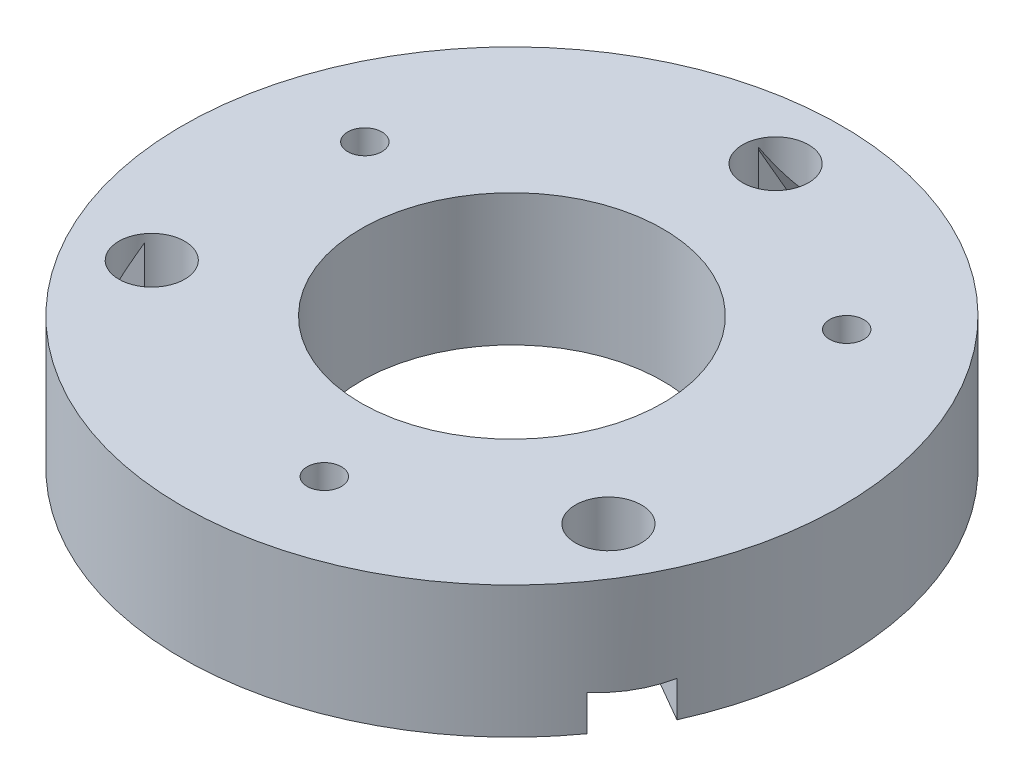
ISO-10303-21;
HEADER;
FILE_DESCRIPTION(('STEP AP214'),'2;1');
FILE_NAME('part.step','',(''),(''),'','','');
FILE_SCHEMA(('AUTOMOTIVE_DESIGN { 1 0 10303 214 1 1 1 1 }'));
ENDSEC;
DATA;
#1=APPLICATION_CONTEXT('core data for automotive mechanical design processes');
#2=APPLICATION_PROTOCOL_DEFINITION('international standard','automotive_design',2000,#1);
#3=PRODUCT_CONTEXT('',#1,'mechanical');
#4=PRODUCT('Part','Part','',(#3));
#5=PRODUCT_RELATED_PRODUCT_CATEGORY('part','',(#4));
#6=PRODUCT_DEFINITION_FORMATION('','',#4);
#7=PRODUCT_DEFINITION_CONTEXT('part definition',#1,'design');
#8=PRODUCT_DEFINITION('design','',#6,#7);
#9=PRODUCT_DEFINITION_SHAPE('','',#8);
#10=(LENGTH_UNIT() NAMED_UNIT(*) SI_UNIT(.MILLI.,.METRE.));
#11=(NAMED_UNIT(*) PLANE_ANGLE_UNIT() SI_UNIT($,.RADIAN.));
#12=(NAMED_UNIT(*) SI_UNIT($,.STERADIAN.) SOLID_ANGLE_UNIT());
#13=UNCERTAINTY_MEASURE_WITH_UNIT(LENGTH_MEASURE(1.E-05),#10,'distance_accuracy_value','');
#14=(GEOMETRIC_REPRESENTATION_CONTEXT(3) GLOBAL_UNCERTAINTY_ASSIGNED_CONTEXT((#13)) GLOBAL_UNIT_ASSIGNED_CONTEXT((#10,
#11,#12)) REPRESENTATION_CONTEXT('',''));
#15=CARTESIAN_POINT('',(0.,0.,0.));
#16=DIRECTION('',(0.,0.,1.));
#17=DIRECTION('',(1.,0.,0.));
#18=AXIS2_PLACEMENT_3D('',#15,#16,#17);
#19=CARTESIAN_POINT('',(0.,25.4,0.));
#20=DIRECTION('',(0.,-1.,0.));
#21=DIRECTION('',(0.,0.,-1.));
#22=AXIS2_PLACEMENT_3D('',#19,#20,#21);
#23=CYLINDRICAL_SURFACE('',#22,63.5);
#24=CARTESIAN_POINT('',(0.,25.4,0.));
#25=DIRECTION('',(0.,1.,0.));
#26=DIRECTION('',(0.,0.,1.));
#27=AXIS2_PLACEMENT_3D('',#24,#25,#26);
#28=CIRCLE('',#27,63.5);
#29=CARTESIAN_POINT('',(0.,25.4,63.5));
#30=VERTEX_POINT('',#29);
#31=EDGE_CURVE('E279',#30,#30,#28,.T.);
#32=ORIENTED_EDGE('',*,*,#31,.F.);
#33=EDGE_LOOP('',(#32));
#34=FACE_BOUND('',#33,.T.);
#35=DIRECTION('',(0.,-1.,0.));
#36=VECTOR('',#35,1.);
#37=CARTESIAN_POINT('',(57.891959208275,25.4,26.0915898141035));
#38=LINE('',#37,#36);
#39=CARTESIAN_POINT('',(57.891959208275,0.,26.0915898141035));
#40=VERTEX_POINT('',#39);
#41=CARTESIAN_POINT('',(57.891959208275,6.90130786407426,26.0915898141035));
#42=VERTEX_POINT('',#41);
#43=EDGE_CURVE('E164',#40,#42,#38,.F.);
#44=ORIENTED_EDGE('',*,*,#43,.F.);
#45=CARTESIAN_POINT('',(0.,0.,0.));
#46=DIRECTION('',(0.,1.,0.));
#47=DIRECTION('',(0.,0.,1.));
#48=AXIS2_PLACEMENT_3D('',#45,#46,#47);
#49=CIRCLE('',#48,63.5);
#50=CARTESIAN_POINT('',(6.35,0.,-63.1817022562704));
#51=VERTEX_POINT('',#50);
#52=EDGE_CURVE('E276',#40,#51,#49,.T.);
#53=ORIENTED_EDGE('',*,*,#52,.T.);
#54=DIRECTION('',(0.,-1.,0.));
#55=VECTOR('',#54,1.);
#56=CARTESIAN_POINT('',(6.35,25.4,-63.1817022562704));
#57=LINE('',#56,#55);
#58=CARTESIAN_POINT('',(6.35,6.90130786407426,-63.1817022562704));
#59=VERTEX_POINT('',#58);
#60=EDGE_CURVE('E293',#51,#59,#57,.F.);
#61=ORIENTED_EDGE('',*,*,#60,.T.);
#62=CARTESIAN_POINT('',(0.,116.335226280624,0.));
#63=DIRECTION('',(0.,0.5,-0.866025403784439));
#64=DIRECTION('',(0.,-0.866025403784439,-0.5));
#65=AXIS2_PLACEMENT_3D('',#62,#63,#64);
#66=ELLIPSE('',#65,127.,63.5);
#67=CARTESIAN_POINT('',(-6.35,6.90130786407426,-63.1817022562704));
#68=VERTEX_POINT('',#67);
#69=EDGE_CURVE('E248',#59,#68,#66,.T.);
#70=ORIENTED_EDGE('',*,*,#69,.T.);
#71=DIRECTION('',(0.,-1.,0.));
#72=VECTOR('',#71,1.);
#73=CARTESIAN_POINT('',(-6.35,25.4,-63.1817022562704));
#74=LINE('',#73,#72);
#75=CARTESIAN_POINT('',(-6.35,0.,-63.1817022562704));
#76=VERTEX_POINT('',#75);
#77=EDGE_CURVE('E296',#76,#68,#74,.F.);
#78=ORIENTED_EDGE('',*,*,#77,.F.);
#79=CARTESIAN_POINT('',(-57.8919592082746,0.,26.0915898141043));
#80=VERTEX_POINT('',#79);
#81=EDGE_CURVE('E283',#76,#80,#49,.T.);
#82=ORIENTED_EDGE('',*,*,#81,.T.);
#83=DIRECTION('',(0.,-1.,0.));
#84=VECTOR('',#83,1.);
#85=CARTESIAN_POINT('',(-57.8919592082746,25.4,26.0915898141043));
#86=LINE('',#85,#84);
#87=CARTESIAN_POINT('',(-57.8919592082746,6.90130786407427,26.0915898141043));
#88=VERTEX_POINT('',#87);
#89=EDGE_CURVE('E222',#80,#88,#86,.F.);
#90=ORIENTED_EDGE('',*,*,#89,.T.);
#91=CARTESIAN_POINT('',(0.,116.335226280624,0.));
#92=DIRECTION('',(-0.749999999999998,0.5,0.433012701892223));
#93=DIRECTION('',(-0.433012701892218,-0.866025403784439,0.250000000000002));
#94=AXIS2_PLACEMENT_3D('',#91,#92,#93);
#95=ELLIPSE('',#94,127.,63.5);
#96=CARTESIAN_POINT('',(-51.5419592082746,6.90130786407426,37.0901124421666));
#97=VERTEX_POINT('',#96);
#98=EDGE_CURVE('E216',#88,#97,#95,.T.);
#99=ORIENTED_EDGE('',*,*,#98,.T.);
#100=DIRECTION('',(0.,-1.,0.));
#101=VECTOR('',#100,1.);
#102=CARTESIAN_POINT('',(-51.5419592082746,25.4,37.0901124421666));
#103=LINE('',#102,#101);
#104=CARTESIAN_POINT('',(-51.5419592082745,0.,37.0901124421666));
#105=VERTEX_POINT('',#104);
#106=EDGE_CURVE('E225',#105,#97,#103,.F.);
#107=ORIENTED_EDGE('',*,*,#106,.F.);
#108=CARTESIAN_POINT('',(51.5419592082751,0.,37.0901124421659));
#109=VERTEX_POINT('',#108);
#110=EDGE_CURVE('E286',#105,#109,#49,.T.);
#111=ORIENTED_EDGE('',*,*,#110,.T.);
#112=DIRECTION('',(0.,-1.,0.));
#113=VECTOR('',#112,1.);
#114=CARTESIAN_POINT('',(51.5419592082751,25.4,37.0901124421659));
#115=LINE('',#114,#113);
#116=CARTESIAN_POINT('',(51.5419592082751,6.90130786407424,37.0901124421659));
#117=VERTEX_POINT('',#116);
#118=EDGE_CURVE('E194',#109,#117,#115,.F.);
#119=ORIENTED_EDGE('',*,*,#118,.T.);
#120=CARTESIAN_POINT('',(0.,116.335226280624,0.));
#121=DIRECTION('',(0.750000000000004,0.5,0.433012701892212));
#122=DIRECTION('',(0.433012701892222,-0.866025403784439,0.249999999999996));
#123=AXIS2_PLACEMENT_3D('',#120,#121,#122);
#124=ELLIPSE('',#123,127.,63.5);
#125=EDGE_CURVE('E191',#117,#42,#124,.T.);
#126=ORIENTED_EDGE('',*,*,#125,.T.);
#127=EDGE_LOOP('',(#44,#53,#61,#70,#78,#82,#90,#99,#107,#111,#119,#126));
#128=FACE_BOUND('',#127,.T.);
#129=ADVANCED_FACE('F33',(#34,#128),#23,.T.);
#130=CARTESIAN_POINT('',(0.,25.4,0.));
#131=DIRECTION('',(0.,1.,0.));
#132=DIRECTION('',(0.,0.,1.));
#133=AXIS2_PLACEMENT_3D('',#130,#131,#132);
#134=PLANE('',#133);
#135=CARTESIAN_POINT('',(8.72378726861535,25.4,44.8799948272273));
#136=DIRECTION('',(0.,1.,0.));
#137=DIRECTION('',(0.866025403784443,0.,-0.499999999999992));
#138=AXIS2_PLACEMENT_3D('',#135,#136,#137);
#139=CIRCLE('',#138,3.30200000000001);
#140=CARTESIAN_POINT('',(11.5834031519116,25.4,43.2289948272273));
#141=VERTEX_POINT('',#140);
#142=EDGE_CURVE('E329',#141,#141,#139,.T.);
#143=ORIENTED_EDGE('',*,*,#142,.F.);
#144=EDGE_LOOP('',(#143));
#145=FACE_BOUND('',#144,.T.);
#146=CARTESIAN_POINT('',(34.5053220077852,25.4,-29.9950188054459));
#147=DIRECTION('',(0.,1.,0.));
#148=DIRECTION('',(-0.866025403784436,0.,-0.500000000000004));
#149=AXIS2_PLACEMENT_3D('',#146,#147,#148);
#150=CIRCLE('',#149,3.30200000000001);
#151=CARTESIAN_POINT('',(31.645706124489,25.4,-31.646018805446));
#152=VERTEX_POINT('',#151);
#153=EDGE_CURVE('E323',#152,#152,#150,.T.);
#154=ORIENTED_EDGE('',*,*,#153,.F.);
#155=EDGE_LOOP('',(#154));
#156=FACE_BOUND('',#155,.T.);
#157=CARTESIAN_POINT('',(-43.2291092764008,25.4,-14.8849760217811));
#158=DIRECTION('',(0.,1.,0.));
#159=DIRECTION('',(0.,0.,1.));
#160=AXIS2_PLACEMENT_3D('',#157,#158,#159);
#161=CIRCLE('',#160,3.30200000000001);
#162=CARTESIAN_POINT('',(-43.2291092764008,25.4,-11.5829760217811));
#163=VERTEX_POINT('',#162);
#164=EDGE_CURVE('E317',#163,#163,#161,.T.);
#165=ORIENTED_EDGE('',*,*,#164,.F.);
#166=EDGE_LOOP('',(#165));
#167=FACE_BOUND('',#166,.T.);
#168=CARTESIAN_POINT('',(43.9940905122527,25.4,25.3999999999981));
#169=DIRECTION('',(0.,1.,0.));
#170=DIRECTION('',(0.,0.,1.));
#171=AXIS2_PLACEMENT_3D('',#168,#169,#170);
#172=CIRCLE('',#171,6.35000000000278);
#173=CARTESIAN_POINT('',(43.9940905122527,25.4,31.7500000000009));
#174=VERTEX_POINT('',#173);
#175=EDGE_CURVE('E261',#174,#174,#172,.T.);
#176=ORIENTED_EDGE('',*,*,#175,.F.);
#177=EDGE_LOOP('',(#176));
#178=FACE_BOUND('',#177,.T.);
#179=CARTESIAN_POINT('',(0.,25.4,0.));
#180=DIRECTION('',(0.,1.,0.));
#181=DIRECTION('',(0.,0.,1.));
#182=AXIS2_PLACEMENT_3D('',#179,#180,#181);
#183=CIRCLE('',#182,29.083);
#184=CARTESIAN_POINT('',(0.,25.4,29.083));
#185=VERTEX_POINT('',#184);
#186=EDGE_CURVE('E273',#185,#185,#183,.T.);
#187=ORIENTED_EDGE('',*,*,#186,.F.);
#188=EDGE_LOOP('',(#187));
#189=FACE_BOUND('',#188,.T.);
#190=ORIENTED_EDGE('',*,*,#31,.T.);
#191=EDGE_LOOP('',(#190));
#192=FACE_BOUND('',#191,.T.);
#193=CARTESIAN_POINT('',(0.,25.4,-50.8));
#194=DIRECTION('',(0.,1.,0.));
#195=DIRECTION('',(0.,0.,1.));
#196=AXIS2_PLACEMENT_3D('',#193,#194,#195);
#197=CIRCLE('',#196,6.35);
#198=CARTESIAN_POINT('',(0.,25.4,-44.45));
#199=VERTEX_POINT('',#198);
#200=EDGE_CURVE('E267',#199,#199,#197,.T.);
#201=ORIENTED_EDGE('',*,*,#200,.F.);
#202=EDGE_LOOP('',(#201));
#203=FACE_BOUND('',#202,.T.);
#204=CARTESIAN_POINT('',(-43.9940905122462,25.4,25.4000000000019));
#205=DIRECTION('',(0.,1.,0.));
#206=DIRECTION('',(0.,0.,1.));
#207=AXIS2_PLACEMENT_3D('',#204,#205,#206);
#208=CIRCLE('',#207,6.35000000000412);
#209=CARTESIAN_POINT('',(-43.9940905122462,25.4,31.750000000006));
#210=VERTEX_POINT('',#209);
#211=EDGE_CURVE('E255',#210,#210,#208,.T.);
#212=ORIENTED_EDGE('',*,*,#211,.F.);
#213=EDGE_LOOP('',(#212));
#214=FACE_BOUND('',#213,.T.);
#215=ADVANCED_FACE('F344',(#145,#156,#167,#178,#189,#192,#203,#214),#134,.T.);
#216=CARTESIAN_POINT('',(0.,0.,0.));
#217=DIRECTION('',(0.,1.,0.));
#218=DIRECTION('',(0.,0.,1.));
#219=AXIS2_PLACEMENT_3D('',#216,#217,#218);
#220=PLANE('',#219);
#221=CARTESIAN_POINT('',(8.72378726861535,0.,44.8799948272273));
#222=DIRECTION('',(0.,1.,0.));
#223=DIRECTION('',(0.866025403784443,0.,-0.499999999999992));
#224=AXIS2_PLACEMENT_3D('',#221,#222,#223);
#225=CIRCLE('',#224,3.30200000000001);
#226=CARTESIAN_POINT('',(11.5834031519116,0.,43.2289948272273));
#227=VERTEX_POINT('',#226);
#228=EDGE_CURVE('E326',#227,#227,#225,.T.);
#229=ORIENTED_EDGE('',*,*,#228,.T.);
#230=EDGE_LOOP('',(#229));
#231=FACE_BOUND('',#230,.T.);
#232=CARTESIAN_POINT('',(34.5053220077852,0.,-29.9950188054459));
#233=DIRECTION('',(0.,1.,0.));
#234=DIRECTION('',(-0.866025403784436,0.,-0.500000000000004));
#235=AXIS2_PLACEMENT_3D('',#232,#233,#234);
#236=CIRCLE('',#235,3.30200000000001);
#237=CARTESIAN_POINT('',(31.645706124489,0.,-31.646018805446));
#238=VERTEX_POINT('',#237);
#239=EDGE_CURVE('E320',#238,#238,#236,.T.);
#240=ORIENTED_EDGE('',*,*,#239,.T.);
#241=EDGE_LOOP('',(#240));
#242=FACE_BOUND('',#241,.T.);
#243=CARTESIAN_POINT('',(-43.2291092764008,0.,-14.8849760217811));
#244=DIRECTION('',(0.,1.,0.));
#245=DIRECTION('',(0.,0.,1.));
#246=AXIS2_PLACEMENT_3D('',#243,#244,#245);
#247=CIRCLE('',#246,3.30200000000001);
#248=CARTESIAN_POINT('',(-43.2291092764008,0.,-11.5829760217811));
#249=VERTEX_POINT('',#248);
#250=EDGE_CURVE('E186',#249,#249,#247,.T.);
#251=ORIENTED_EDGE('',*,*,#250,.T.);
#252=EDGE_LOOP('',(#251));
#253=FACE_BOUND('',#252,.T.);
#254=CARTESIAN_POINT('',(0.,0.,0.));
#255=DIRECTION('',(0.,1.,0.));
#256=DIRECTION('',(0.,0.,1.));
#257=AXIS2_PLACEMENT_3D('',#254,#255,#256);
#258=CIRCLE('',#257,29.083);
#259=CARTESIAN_POINT('',(0.,0.,29.083));
#260=VERTEX_POINT('',#259);
#261=EDGE_CURVE('E270',#260,#260,#258,.T.);
#262=ORIENTED_EDGE('',*,*,#261,.T.);
#263=EDGE_LOOP('',(#262));
#264=FACE_BOUND('',#263,.T.);
#265=DIRECTION('',(0.866025403784443,0.,0.499999999999992));
#266=VECTOR('',#265,1.);
#267=CARTESIAN_POINT('',(49.3863924359884,0.,21.1808985485136));
#268=LINE('',#267,#266);
#269=CARTESIAN_POINT('',(49.3863924359884,0.,21.1808985485136));
#270=VERTEX_POINT('',#269);
#271=EDGE_CURVE('E165',#270,#40,#268,.T.);
#272=ORIENTED_EDGE('',*,*,#271,.F.);
#273=DIRECTION('',(-0.499999999999992,0.,0.866025403784443));
#274=VECTOR('',#273,1.);
#275=CARTESIAN_POINT('',(49.3863924359884,0.,21.1808985485136));
#276=LINE('',#275,#274);
#277=CARTESIAN_POINT('',(49.1168727278416,0.,21.6477203766649));
#278=VERTEX_POINT('',#277);
#279=EDGE_CURVE('E178',#270,#278,#276,.T.);
#280=ORIENTED_EDGE('',*,*,#279,.T.);
#281=CARTESIAN_POINT('',(43.9940905122527,0.,25.3999999999981));
#282=DIRECTION('',(0.,1.,0.));
#283=DIRECTION('',(0.,0.,1.));
#284=AXIS2_PLACEMENT_3D('',#281,#282,#283);
#285=CIRCLE('',#284,6.35000000000278);
#286=CARTESIAN_POINT('',(43.305912144138,0.,31.7125993484198));
#287=VERTEX_POINT('',#286);
#288=EDGE_CURVE('E258',#278,#287,#285,.T.);
#289=ORIENTED_EDGE('',*,*,#288,.T.);
#290=CARTESIAN_POINT('',(43.0363924359885,0.,32.179421176576));
#291=VERTEX_POINT('',#290);
#292=EDGE_CURVE('E174',#287,#291,#276,.T.);
#293=ORIENTED_EDGE('',*,*,#292,.T.);
#294=DIRECTION('',(0.866025403784443,0.,0.499999999999992));
#295=VECTOR('',#294,1.);
#296=CARTESIAN_POINT('',(43.0363924359885,0.,32.179421176576));
#297=LINE('',#296,#295);
#298=EDGE_CURVE('E182',#291,#109,#297,.T.);
#299=ORIENTED_EDGE('',*,*,#298,.T.);
#300=ORIENTED_EDGE('',*,*,#110,.F.);
#301=DIRECTION('',(-0.866025403784436,0.,0.500000000000004));
#302=VECTOR('',#301,1.);
#303=CARTESIAN_POINT('',(-43.036392435988,0.,32.1794211765766));
#304=LINE('',#303,#302);
#305=CARTESIAN_POINT('',(-43.036392435988,0.,32.1794211765766));
#306=VERTEX_POINT('',#305);
#307=EDGE_CURVE('E199',#306,#105,#304,.T.);
#308=ORIENTED_EDGE('',*,*,#307,.F.);
#309=DIRECTION('',(-0.500000000000004,0.,-0.866025403784436));
#310=VECTOR('',#309,1.);
#311=CARTESIAN_POINT('',(-43.036392435988,0.,32.1794211765766));
#312=LINE('',#311,#310);
#313=CARTESIAN_POINT('',(-43.3059121441348,0.,31.7125993484253));
#314=VERTEX_POINT('',#313);
#315=EDGE_CURVE('E213',#306,#314,#312,.T.);
#316=ORIENTED_EDGE('',*,*,#315,.T.);
#317=CARTESIAN_POINT('',(-43.9940905122462,0.,25.4000000000019));
#318=DIRECTION('',(0.,1.,0.));
#319=DIRECTION('',(0.,0.,1.));
#320=AXIS2_PLACEMENT_3D('',#317,#318,#319);
#321=CIRCLE('',#320,6.35000000000412);
#322=CARTESIAN_POINT('',(-49.1168727278383,0.,21.6477203766708));
#323=VERTEX_POINT('',#322);
#324=EDGE_CURVE('E254',#314,#323,#321,.T.);
#325=ORIENTED_EDGE('',*,*,#324,.T.);
#326=CARTESIAN_POINT('',(-49.3863924359881,0.,21.1808985485143));
#327=VERTEX_POINT('',#326);
#328=EDGE_CURVE('E217',#323,#327,#312,.T.);
#329=ORIENTED_EDGE('',*,*,#328,.T.);
#330=DIRECTION('',(-0.866025403784436,0.,0.500000000000004));
#331=VECTOR('',#330,1.);
#332=CARTESIAN_POINT('',(-49.3863924359881,0.,21.1808985485143));
#333=LINE('',#332,#331);
#334=EDGE_CURVE('E198',#327,#80,#333,.T.);
#335=ORIENTED_EDGE('',*,*,#334,.T.);
#336=ORIENTED_EDGE('',*,*,#81,.F.);
#337=DIRECTION('',(0.,0.,-1.));
#338=VECTOR('',#337,1.);
#339=CARTESIAN_POINT('',(-6.35,0.,-53.3603197250904));
#340=LINE('',#339,#338);
#341=CARTESIAN_POINT('',(-6.35,0.,-53.3603197250904));
#342=VERTEX_POINT('',#341);
#343=EDGE_CURVE('E229',#342,#76,#340,.T.);
#344=ORIENTED_EDGE('',*,*,#343,.F.);
#345=DIRECTION('',(1.,0.,0.));
#346=VECTOR('',#345,1.);
#347=CARTESIAN_POINT('',(-6.35,0.,-53.3603197250904));
#348=LINE('',#347,#346);
#349=CARTESIAN_POINT('',(-5.81096058369982,0.,-53.3603197250904));
#350=VERTEX_POINT('',#349);
#351=EDGE_CURVE('E245',#342,#350,#348,.T.);
#352=ORIENTED_EDGE('',*,*,#351,.T.);
#353=CARTESIAN_POINT('',(0.,0.,-50.8));
#354=DIRECTION('',(0.,1.,0.));
#355=DIRECTION('',(0.,0.,1.));
#356=AXIS2_PLACEMENT_3D('',#353,#354,#355);
#357=CIRCLE('',#356,6.35);
#358=CARTESIAN_POINT('',(5.81096058369982,0.,-53.3603197250904));
#359=VERTEX_POINT('',#358);
#360=EDGE_CURVE('E264',#350,#359,#357,.T.);
#361=ORIENTED_EDGE('',*,*,#360,.T.);
#362=CARTESIAN_POINT('',(6.35,0.,-53.3603197250904));
#363=VERTEX_POINT('',#362);
#364=EDGE_CURVE('E249',#359,#363,#348,.T.);
#365=ORIENTED_EDGE('',*,*,#364,.T.);
#366=DIRECTION('',(0.,0.,-1.));
#367=VECTOR('',#366,1.);
#368=CARTESIAN_POINT('',(6.35,0.,-53.3603197250904));
#369=LINE('',#368,#367);
#370=EDGE_CURVE('E228',#363,#51,#369,.T.);
#371=ORIENTED_EDGE('',*,*,#370,.T.);
#372=ORIENTED_EDGE('',*,*,#52,.F.);
#373=EDGE_LOOP('',(#272,#280,#289,#293,#299,#300,#308,#316,#325,#329,#335,#336,#344,#352,#361,
#365,#371,#372));
#374=FACE_BOUND('',#373,.T.);
#375=ADVANCED_FACE('F314',(#231,#242,#253,#264,#374),#220,.F.);
#376=CARTESIAN_POINT('',(0.,25.4,0.));
#377=DIRECTION('',(0.,-1.,0.));
#378=DIRECTION('',(0.,0.,-1.));
#379=AXIS2_PLACEMENT_3D('',#376,#377,#378);
#380=CYLINDRICAL_SURFACE('',#379,29.083);
#381=ORIENTED_EDGE('',*,*,#186,.T.);
#382=EDGE_LOOP('',(#381));
#383=FACE_BOUND('',#382,.T.);
#384=ORIENTED_EDGE('',*,*,#261,.F.);
#385=EDGE_LOOP('',(#384));
#386=FACE_BOUND('',#385,.T.);
#387=ADVANCED_FACE('F591',(#383,#386),#380,.F.);
#388=CARTESIAN_POINT('',(0.,25.4,-50.8));
#389=DIRECTION('',(0.,-1.,0.));
#390=DIRECTION('',(0.,0.,-1.));
#391=AXIS2_PLACEMENT_3D('',#388,#389,#390);
#392=CYLINDRICAL_SURFACE('',#391,6.35);
#393=DIRECTION('',(0.,-1.,0.));
#394=VECTOR('',#393,1.);
#395=CARTESIAN_POINT('',(-5.81096058369982,25.4,-53.3603197250904));
#396=LINE('',#395,#394);
#397=CARTESIAN_POINT('',(-5.81096058369982,23.9124414086474,-53.3603197250904));
#398=VERTEX_POINT('',#397);
#399=EDGE_CURVE('E291',#398,#350,#396,.T.);
#400=ORIENTED_EDGE('',*,*,#399,.F.);
#401=CARTESIAN_POINT('',(0.,28.3470452561248,-50.8));
#402=DIRECTION('',(0.,0.5,-0.866025403784439));
#403=DIRECTION('',(0.,-0.866025403784439,-0.5));
#404=AXIS2_PLACEMENT_3D('',#401,#402,#403);
#405=ELLIPSE('',#404,12.7,6.35);
#406=CARTESIAN_POINT('',(5.81096058369982,23.9124414086474,-53.3603197250904));
#407=VERTEX_POINT('',#406);
#408=EDGE_CURVE('E282',#407,#398,#405,.T.);
#409=ORIENTED_EDGE('',*,*,#408,.F.);
#410=DIRECTION('',(0.,-1.,0.));
#411=VECTOR('',#410,1.);
#412=CARTESIAN_POINT('',(5.81096058369982,25.4,-53.3603197250904));
#413=LINE('',#412,#411);
#414=EDGE_CURVE('E288',#359,#407,#413,.F.);
#415=ORIENTED_EDGE('',*,*,#414,.F.);
#416=ORIENTED_EDGE('',*,*,#360,.F.);
#417=EDGE_LOOP('',(#400,#409,#415,#416));
#418=FACE_BOUND('',#417,.T.);
#419=ORIENTED_EDGE('',*,*,#200,.T.);
#420=EDGE_LOOP('',(#419));
#421=FACE_BOUND('',#420,.T.);
#422=ADVANCED_FACE('F374',(#418,#421),#392,.F.);
#423=CARTESIAN_POINT('',(43.9940905122527,25.4,25.3999999999981));
#424=DIRECTION('',(0.,-1.,0.));
#425=DIRECTION('',(0.,0.,-1.));
#426=AXIS2_PLACEMENT_3D('',#423,#424,#425);
#427=CYLINDRICAL_SURFACE('',#426,6.35000000000278);
#428=DIRECTION('',(0.,-1.,0.));
#429=VECTOR('',#428,1.);
#430=CARTESIAN_POINT('',(49.1168727278416,25.4,21.6477203766649));
#431=LINE('',#430,#429);
#432=CARTESIAN_POINT('',(49.1168727278416,23.9124414086474,21.6477203766649));
#433=VERTEX_POINT('',#432);
#434=EDGE_CURVE('E11',#433,#278,#431,.T.);
#435=ORIENTED_EDGE('',*,*,#434,.F.);
#436=CARTESIAN_POINT('',(43.9940905122527,28.3470452561215,25.3999999999981));
#437=DIRECTION('',(0.750000000000004,0.5,0.433012701892212));
#438=DIRECTION('',(0.433012701892222,-0.866025403784439,0.249999999999996));
#439=AXIS2_PLACEMENT_3D('',#436,#437,#438);
#440=ELLIPSE('',#439,12.7000000000056,6.35000000000278);
#441=CARTESIAN_POINT('',(43.305912144138,23.9124414086474,31.7125993484198));
#442=VERTEX_POINT('',#441);
#443=EDGE_CURVE('E171',#442,#433,#440,.T.);
#444=ORIENTED_EDGE('',*,*,#443,.F.);
#445=DIRECTION('',(0.,-1.,0.));
#446=VECTOR('',#445,1.);
#447=CARTESIAN_POINT('',(43.305912144138,25.4,31.7125993484198));
#448=LINE('',#447,#446);
#449=EDGE_CURVE('E40',#287,#442,#448,.F.);
#450=ORIENTED_EDGE('',*,*,#449,.F.);
#451=ORIENTED_EDGE('',*,*,#288,.F.);
#452=EDGE_LOOP('',(#435,#444,#450,#451));
#453=FACE_BOUND('',#452,.T.);
#454=ORIENTED_EDGE('',*,*,#175,.T.);
#455=EDGE_LOOP('',(#454));
#456=FACE_BOUND('',#455,.T.);
#457=ADVANCED_FACE('F311',(#453,#456),#427,.F.);
#458=CARTESIAN_POINT('',(-43.9940905122462,25.4,25.4000000000019));
#459=DIRECTION('',(0.,-1.,0.));
#460=DIRECTION('',(0.,0.,-1.));
#461=AXIS2_PLACEMENT_3D('',#458,#459,#460);
#462=CYLINDRICAL_SURFACE('',#461,6.35000000000412);
#463=DIRECTION('',(0.,-1.,0.));
#464=VECTOR('',#463,1.);
#465=CARTESIAN_POINT('',(-43.3059121441348,25.4,31.7125993484253));
#466=LINE('',#465,#464);
#467=CARTESIAN_POINT('',(-43.3059121441348,23.9124414086474,31.7125993484253));
#468=VERTEX_POINT('',#467);
#469=EDGE_CURVE('E303',#468,#314,#466,.T.);
#470=ORIENTED_EDGE('',*,*,#469,.F.);
#471=CARTESIAN_POINT('',(-43.9940905122462,28.347045256128,25.4000000000019));
#472=DIRECTION('',(-0.749999999999998,0.5,0.433012701892223));
#473=DIRECTION('',(-0.433012701892218,-0.866025403784439,0.250000000000002));
#474=AXIS2_PLACEMENT_3D('',#471,#472,#473);
#475=ELLIPSE('',#474,12.7000000000082,6.35000000000412);
#476=CARTESIAN_POINT('',(-49.1168727278383,23.9124414086474,21.6477203766708));
#477=VERTEX_POINT('',#476);
#478=EDGE_CURVE('E299',#477,#468,#475,.T.);
#479=ORIENTED_EDGE('',*,*,#478,.F.);
#480=DIRECTION('',(0.,-1.,0.));
#481=VECTOR('',#480,1.);
#482=CARTESIAN_POINT('',(-49.1168727278383,25.4,21.6477203766708));
#483=LINE('',#482,#481);
#484=EDGE_CURVE('E301',#323,#477,#483,.F.);
#485=ORIENTED_EDGE('',*,*,#484,.F.);
#486=ORIENTED_EDGE('',*,*,#324,.F.);
#487=EDGE_LOOP('',(#470,#479,#485,#486));
#488=FACE_BOUND('',#487,.T.);
#489=ORIENTED_EDGE('',*,*,#211,.T.);
#490=EDGE_LOOP('',(#489));
#491=FACE_BOUND('',#490,.T.);
#492=ADVANCED_FACE('F362',(#488,#491),#462,.F.);
#493=CARTESIAN_POINT('',(-6.35,0.,0.));
#494=DIRECTION('',(1.,0.,0.));
#495=DIRECTION('',(0.,0.,-1.));
#496=AXIS2_PLACEMENT_3D('',#493,#494,#495);
#497=PLANE('',#496);
#498=ORIENTED_EDGE('',*,*,#77,.T.);
#499=DIRECTION('',(0.,0.866025403784439,0.5));
#500=VECTOR('',#499,1.);
#501=CARTESIAN_POINT('',(-6.35,6.35,-63.5));
#502=LINE('',#501,#500);
#503=CARTESIAN_POINT('',(-6.35,23.9124414086474,-53.3603197250904));
#504=VERTEX_POINT('',#503);
#505=EDGE_CURVE('E231',#68,#504,#502,.T.);
#506=ORIENTED_EDGE('',*,*,#505,.T.);
#507=DIRECTION('',(0.,-1.,0.));
#508=VECTOR('',#507,1.);
#509=CARTESIAN_POINT('',(-6.35,23.9124414086474,-53.3603197250904));
#510=LINE('',#509,#508);
#511=EDGE_CURVE('E234',#504,#342,#510,.T.);
#512=ORIENTED_EDGE('',*,*,#511,.T.);
#513=ORIENTED_EDGE('',*,*,#343,.T.);
#514=EDGE_LOOP('',(#498,#506,#512,#513));
#515=FACE_BOUND('',#514,.T.);
#516=ADVANCED_FACE('F364',(#515),#497,.T.);
#517=CARTESIAN_POINT('',(6.35,0.,0.));
#518=DIRECTION('',(1.,0.,0.));
#519=DIRECTION('',(0.,0.,-1.));
#520=AXIS2_PLACEMENT_3D('',#517,#518,#519);
#521=PLANE('',#520);
#522=ORIENTED_EDGE('',*,*,#370,.F.);
#523=DIRECTION('',(0.,-1.,0.));
#524=VECTOR('',#523,1.);
#525=CARTESIAN_POINT('',(6.35,23.9124414086474,-53.3603197250904));
#526=LINE('',#525,#524);
#527=CARTESIAN_POINT('',(6.35,23.9124414086474,-53.3603197250904));
#528=VERTEX_POINT('',#527);
#529=EDGE_CURVE('E232',#528,#363,#526,.T.);
#530=ORIENTED_EDGE('',*,*,#529,.F.);
#531=DIRECTION('',(0.,0.866025403784439,0.5));
#532=VECTOR('',#531,1.);
#533=CARTESIAN_POINT('',(6.35,6.35,-63.5));
#534=LINE('',#533,#532);
#535=EDGE_CURVE('E240',#59,#528,#534,.T.);
#536=ORIENTED_EDGE('',*,*,#535,.F.);
#537=ORIENTED_EDGE('',*,*,#60,.F.);
#538=EDGE_LOOP('',(#522,#530,#536,#537));
#539=FACE_BOUND('',#538,.T.);
#540=ADVANCED_FACE('F371',(#539),#521,.F.);
#541=CARTESIAN_POINT('',(-6.35,23.9124414086474,-53.3603197250904));
#542=DIRECTION('',(0.,0.,1.));
#543=DIRECTION('',(0.,-1.,0.));
#544=AXIS2_PLACEMENT_3D('',#541,#542,#543);
#545=PLANE('',#544);
#546=ORIENTED_EDGE('',*,*,#399,.T.);
#547=ORIENTED_EDGE('',*,*,#351,.F.);
#548=ORIENTED_EDGE('',*,*,#511,.F.);
#549=DIRECTION('',(1.,0.,0.));
#550=VECTOR('',#549,1.);
#551=CARTESIAN_POINT('',(-6.35,23.9124414086474,-53.3603197250904));
#552=LINE('',#551,#550);
#553=EDGE_CURVE('E250',#504,#398,#552,.T.);
#554=ORIENTED_EDGE('',*,*,#553,.T.);
#555=EDGE_LOOP('',(#546,#547,#548,#554));
#556=FACE_BOUND('',#555,.T.);
#557=ADVANCED_FACE('F421',(#556),#545,.F.);
#558=CARTESIAN_POINT('',(-6.35,6.35,-63.5));
#559=DIRECTION('',(0.,0.5,-0.866025403784439));
#560=DIRECTION('',(0.,0.866025403784439,0.5));
#561=AXIS2_PLACEMENT_3D('',#558,#559,#560);
#562=PLANE('',#561);
#563=ORIENTED_EDGE('',*,*,#69,.F.);
#564=ORIENTED_EDGE('',*,*,#535,.T.);
#565=EDGE_CURVE('E237',#407,#528,#552,.T.);
#566=ORIENTED_EDGE('',*,*,#565,.F.);
#567=ORIENTED_EDGE('',*,*,#408,.T.);
#568=ORIENTED_EDGE('',*,*,#553,.F.);
#569=ORIENTED_EDGE('',*,*,#505,.F.);
#570=EDGE_LOOP('',(#563,#564,#566,#567,#568,#569));
#571=FACE_BOUND('',#570,.T.);
#572=ADVANCED_FACE('F415',(#571),#562,.F.);
#573=ORIENTED_EDGE('',*,*,#414,.T.);
#574=ORIENTED_EDGE('',*,*,#565,.T.);
#575=ORIENTED_EDGE('',*,*,#529,.T.);
#576=ORIENTED_EDGE('',*,*,#364,.F.);
#577=EDGE_LOOP('',(#573,#574,#575,#576));
#578=FACE_BOUND('',#577,.T.);
#579=ADVANCED_FACE('F428',(#578),#545,.F.);
#580=CARTESIAN_POINT('',(3.17500000000003,0.,5.49926131403117));
#581=DIRECTION('',(-0.500000000000004,0.,-0.866025403784436));
#582=DIRECTION('',(-0.866025403784436,0.,0.500000000000004));
#583=AXIS2_PLACEMENT_3D('',#580,#581,#582);
#584=PLANE('',#583);
#585=ORIENTED_EDGE('',*,*,#106,.T.);
#586=DIRECTION('',(0.433012701892218,0.866025403784439,-0.250000000000002));
#587=VECTOR('',#586,1.);
#588=CARTESIAN_POINT('',(-51.8176131403117,6.35,37.2492613140314));
#589=LINE('',#588,#587);
#590=CARTESIAN_POINT('',(-43.036392435988,23.9124414086474,32.1794211765766));
#591=VERTEX_POINT('',#590);
#592=EDGE_CURVE('E201',#97,#591,#589,.T.);
#593=ORIENTED_EDGE('',*,*,#592,.T.);
#594=DIRECTION('',(0.,-1.,0.));
#595=VECTOR('',#594,1.);
#596=CARTESIAN_POINT('',(-43.036392435988,23.9124414086474,32.1794211765766));
#597=LINE('',#596,#595);
#598=EDGE_CURVE('E204',#591,#306,#597,.T.);
#599=ORIENTED_EDGE('',*,*,#598,.T.);
#600=ORIENTED_EDGE('',*,*,#307,.T.);
#601=EDGE_LOOP('',(#585,#593,#599,#600));
#602=FACE_BOUND('',#601,.T.);
#603=ADVANCED_FACE('F394',(#602),#584,.T.);
#604=CARTESIAN_POINT('',(-3.17500000000003,0.,-5.49926131403117));
#605=DIRECTION('',(-0.500000000000004,0.,-0.866025403784436));
#606=DIRECTION('',(-0.866025403784436,0.,0.500000000000004));
#607=AXIS2_PLACEMENT_3D('',#604,#605,#606);
#608=PLANE('',#607);
#609=ORIENTED_EDGE('',*,*,#334,.F.);
#610=DIRECTION('',(0.,-1.,0.));
#611=VECTOR('',#610,1.);
#612=CARTESIAN_POINT('',(-49.3863924359881,23.9124414086474,21.1808985485142));
#613=LINE('',#612,#611);
#614=CARTESIAN_POINT('',(-49.3863924359881,23.9124414086474,21.1808985485142));
#615=VERTEX_POINT('',#614);
#616=EDGE_CURVE('E202',#615,#327,#613,.T.);
#617=ORIENTED_EDGE('',*,*,#616,.F.);
#618=DIRECTION('',(0.433012701892218,0.866025403784439,-0.250000000000002));
#619=VECTOR('',#618,1.);
#620=CARTESIAN_POINT('',(-58.1676131403117,6.35,26.2507386859691));
#621=LINE('',#620,#619);
#622=EDGE_CURVE('E209',#88,#615,#621,.T.);
#623=ORIENTED_EDGE('',*,*,#622,.F.);
#624=ORIENTED_EDGE('',*,*,#89,.F.);
#625=EDGE_LOOP('',(#609,#617,#623,#624));
#626=FACE_BOUND('',#625,.T.);
#627=ADVANCED_FACE('F454',(#626),#608,.F.);
#628=CARTESIAN_POINT('',(-43.036392435988,23.9124414086474,32.1794211765766));
#629=DIRECTION('',(0.866025403784436,0.,-0.500000000000004));
#630=DIRECTION('',(-0.500000000000004,0.,-0.866025403784436));
#631=AXIS2_PLACEMENT_3D('',#628,#629,#630);
#632=PLANE('',#631);
#633=ORIENTED_EDGE('',*,*,#469,.T.);
#634=ORIENTED_EDGE('',*,*,#315,.F.);
#635=ORIENTED_EDGE('',*,*,#598,.F.);
#636=DIRECTION('',(-0.500000000000004,0.,-0.866025403784436));
#637=VECTOR('',#636,1.);
#638=CARTESIAN_POINT('',(-43.036392435988,23.9124414086474,32.1794211765766));
#639=LINE('',#638,#637);
#640=EDGE_CURVE('E218',#591,#468,#639,.T.);
#641=ORIENTED_EDGE('',*,*,#640,.T.);
#642=EDGE_LOOP('',(#633,#634,#635,#641));
#643=FACE_BOUND('',#642,.T.);
#644=ADVANCED_FACE('F401',(#643),#632,.F.);
#645=CARTESIAN_POINT('',(-51.8176131403117,6.35,37.2492613140314));
#646=DIRECTION('',(-0.749999999999998,0.5,0.433012701892223));
#647=DIRECTION('',(-0.55470019622523,-0.832050294337843,0.));
#648=AXIS2_PLACEMENT_3D('',#645,#646,#647);
#649=PLANE('',#648);
#650=ORIENTED_EDGE('',*,*,#98,.F.);
#651=ORIENTED_EDGE('',*,*,#622,.T.);
#652=EDGE_CURVE('E55',#477,#615,#639,.T.);
#653=ORIENTED_EDGE('',*,*,#652,.F.);
#654=ORIENTED_EDGE('',*,*,#478,.T.);
#655=ORIENTED_EDGE('',*,*,#640,.F.);
#656=ORIENTED_EDGE('',*,*,#592,.F.);
#657=EDGE_LOOP('',(#650,#651,#653,#654,#655,#656));
#658=FACE_BOUND('',#657,.T.);
#659=ADVANCED_FACE('F396',(#658),#649,.F.);
#660=ORIENTED_EDGE('',*,*,#484,.T.);
#661=ORIENTED_EDGE('',*,*,#652,.T.);
#662=ORIENTED_EDGE('',*,*,#616,.T.);
#663=ORIENTED_EDGE('',*,*,#328,.F.);
#664=EDGE_LOOP('',(#660,#661,#662,#663));
#665=FACE_BOUND('',#664,.T.);
#666=ADVANCED_FACE('F406',(#665),#632,.F.);
#667=CARTESIAN_POINT('',(3.17499999999995,0.,-5.49926131403121));
#668=DIRECTION('',(-0.499999999999992,0.,0.866025403784443));
#669=DIRECTION('',(0.866025403784443,0.,0.499999999999992));
#670=AXIS2_PLACEMENT_3D('',#667,#668,#669);
#671=PLANE('',#670);
#672=ORIENTED_EDGE('',*,*,#43,.T.);
#673=DIRECTION('',(-0.433012701892222,0.866025403784439,-0.249999999999996));
#674=VECTOR('',#673,1.);
#675=CARTESIAN_POINT('',(58.1676131403121,6.35,26.2507386859683));
#676=LINE('',#675,#674);
#677=CARTESIAN_POINT('',(49.3863924359884,23.9124414086474,21.1808985485136));
#678=VERTEX_POINT('',#677);
#679=EDGE_CURVE('E157',#42,#678,#676,.T.);
#680=ORIENTED_EDGE('',*,*,#679,.T.);
#681=DIRECTION('',(0.,-1.,0.));
#682=VECTOR('',#681,1.);
#683=CARTESIAN_POINT('',(49.3863924359884,23.9124414086474,21.1808985485136));
#684=LINE('',#683,#682);
#685=EDGE_CURVE('E161',#678,#270,#684,.T.);
#686=ORIENTED_EDGE('',*,*,#685,.T.);
#687=ORIENTED_EDGE('',*,*,#271,.T.);
#688=EDGE_LOOP('',(#672,#680,#686,#687));
#689=FACE_BOUND('',#688,.T.);
#690=ADVANCED_FACE('F159',(#689),#671,.T.);
#691=CARTESIAN_POINT('',(-3.17499999999995,0.,5.49926131403121));
#692=DIRECTION('',(-0.499999999999992,0.,0.866025403784443));
#693=DIRECTION('',(0.866025403784443,0.,0.499999999999992));
#694=AXIS2_PLACEMENT_3D('',#691,#692,#693);
#695=PLANE('',#694);
#696=ORIENTED_EDGE('',*,*,#298,.F.);
#697=DIRECTION('',(0.,-1.,0.));
#698=VECTOR('',#697,1.);
#699=CARTESIAN_POINT('',(43.0363924359885,23.9124414086474,32.179421176576));
#700=LINE('',#699,#698);
#701=CARTESIAN_POINT('',(43.0363924359885,23.9124414086474,32.179421176576));
#702=VERTEX_POINT('',#701);
#703=EDGE_CURVE('E188',#702,#291,#700,.T.);
#704=ORIENTED_EDGE('',*,*,#703,.F.);
#705=DIRECTION('',(-0.433012701892222,0.866025403784439,-0.249999999999996));
#706=VECTOR('',#705,1.);
#707=CARTESIAN_POINT('',(51.8176131403122,6.35,37.2492613140307));
#708=LINE('',#707,#706);
#709=EDGE_CURVE('E185',#117,#702,#708,.T.);
#710=ORIENTED_EDGE('',*,*,#709,.F.);
#711=ORIENTED_EDGE('',*,*,#118,.F.);
#712=EDGE_LOOP('',(#696,#704,#710,#711));
#713=FACE_BOUND('',#712,.T.);
#714=ADVANCED_FACE('F388',(#713),#695,.F.);
#715=CARTESIAN_POINT('',(49.3863924359884,23.9124414086474,21.1808985485136));
#716=DIRECTION('',(-0.866025403784443,0.,-0.499999999999992));
#717=DIRECTION('',(-0.499999999999992,0.,0.866025403784443));
#718=AXIS2_PLACEMENT_3D('',#715,#716,#717);
#719=PLANE('',#718);
#720=ORIENTED_EDGE('',*,*,#434,.T.);
#721=ORIENTED_EDGE('',*,*,#279,.F.);
#722=ORIENTED_EDGE('',*,*,#685,.F.);
#723=DIRECTION('',(-0.499999999999992,0.,0.866025403784443));
#724=VECTOR('',#723,1.);
#725=CARTESIAN_POINT('',(49.3863924359884,23.9124414086474,21.1808985485136));
#726=LINE('',#725,#724);
#727=EDGE_CURVE('E168',#678,#433,#726,.T.);
#728=ORIENTED_EDGE('',*,*,#727,.T.);
#729=EDGE_LOOP('',(#720,#721,#722,#728));
#730=FACE_BOUND('',#729,.T.);
#731=ADVANCED_FACE('F176',(#730),#719,.F.);
#732=CARTESIAN_POINT('',(58.1676131403121,6.35,26.2507386859683));
#733=DIRECTION('',(0.750000000000004,0.5,0.433012701892212));
#734=DIRECTION('',(-0.554700196225227,0.832050294337845,0.));
#735=AXIS2_PLACEMENT_3D('',#732,#733,#734);
#736=PLANE('',#735);
#737=ORIENTED_EDGE('',*,*,#125,.F.);
#738=ORIENTED_EDGE('',*,*,#709,.T.);
#739=EDGE_CURVE('E47',#442,#702,#726,.T.);
#740=ORIENTED_EDGE('',*,*,#739,.F.);
#741=ORIENTED_EDGE('',*,*,#443,.T.);
#742=ORIENTED_EDGE('',*,*,#727,.F.);
#743=ORIENTED_EDGE('',*,*,#679,.F.);
#744=EDGE_LOOP('',(#737,#738,#740,#741,#742,#743));
#745=FACE_BOUND('',#744,.T.);
#746=ADVANCED_FACE('F169',(#745),#736,.F.);
#747=ORIENTED_EDGE('',*,*,#449,.T.);
#748=ORIENTED_EDGE('',*,*,#739,.T.);
#749=ORIENTED_EDGE('',*,*,#703,.T.);
#750=ORIENTED_EDGE('',*,*,#292,.F.);
#751=EDGE_LOOP('',(#747,#748,#749,#750));
#752=FACE_BOUND('',#751,.T.);
#753=ADVANCED_FACE('F307',(#752),#719,.F.);
#754=CARTESIAN_POINT('',(-43.2291092764008,0.,-14.8849760217811));
#755=DIRECTION('',(0.,1.,0.));
#756=DIRECTION('',(0.,0.,1.));
#757=AXIS2_PLACEMENT_3D('',#754,#755,#756);
#758=CYLINDRICAL_SURFACE('',#757,3.30200000000001);
#759=ORIENTED_EDGE('',*,*,#250,.F.);
#760=EDGE_LOOP('',(#759));
#761=FACE_BOUND('',#760,.T.);
#762=ORIENTED_EDGE('',*,*,#164,.T.);
#763=EDGE_LOOP('',(#762));
#764=FACE_BOUND('',#763,.T.);
#765=ADVANCED_FACE('F507',(#761,#764),#758,.F.);
#766=CARTESIAN_POINT('',(34.5053220077852,0.,-29.9950188054459));
#767=DIRECTION('',(0.,1.,0.));
#768=DIRECTION('',(0.,0.,1.));
#769=AXIS2_PLACEMENT_3D('',#766,#767,#768);
#770=CYLINDRICAL_SURFACE('',#769,3.30200000000001);
#771=ORIENTED_EDGE('',*,*,#239,.F.);
#772=EDGE_LOOP('',(#771));
#773=FACE_BOUND('',#772,.T.);
#774=ORIENTED_EDGE('',*,*,#153,.T.);
#775=EDGE_LOOP('',(#774));
#776=FACE_BOUND('',#775,.T.);
#777=ADVANCED_FACE('F340',(#773,#776),#770,.F.);
#778=CARTESIAN_POINT('',(8.72378726861535,0.,44.8799948272273));
#779=DIRECTION('',(0.,1.,0.));
#780=DIRECTION('',(0.,0.,1.));
#781=AXIS2_PLACEMENT_3D('',#778,#779,#780);
#782=CYLINDRICAL_SURFACE('',#781,3.30200000000001);
#783=ORIENTED_EDGE('',*,*,#228,.F.);
#784=EDGE_LOOP('',(#783));
#785=FACE_BOUND('',#784,.T.);
#786=ORIENTED_EDGE('',*,*,#142,.T.);
#787=EDGE_LOOP('',(#786));
#788=FACE_BOUND('',#787,.T.);
#789=ADVANCED_FACE('F337',(#785,#788),#782,.F.);
#790=CLOSED_SHELL('',(#129,#215,#375,#387,#422,#457,#492,#516,#540,#557,#572,#579,#603,#627,
#644,#659,#666,#690,#714,#731,#746,#753,#765,#777,#789));
#791=MANIFOLD_SOLID_BREP('B2',#790);
#792=ADVANCED_BREP_SHAPE_REPRESENTATION('',(#18,#791),#14);
#793=SHAPE_DEFINITION_REPRESENTATION(#9,#792);
ENDSEC;
END-ISO-10303-21;
